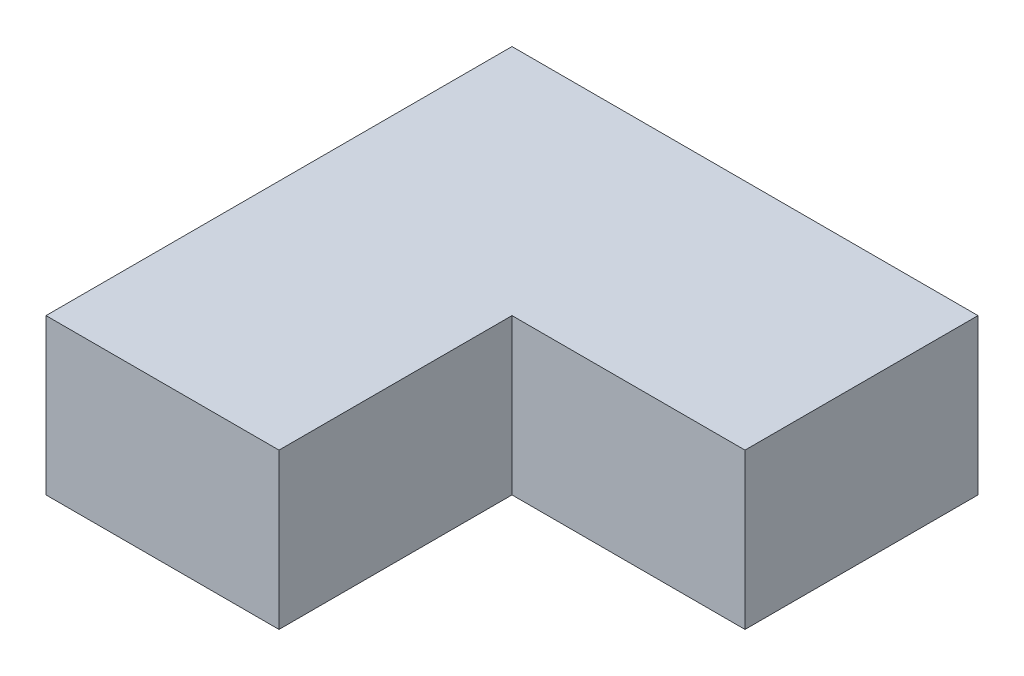
ISO-10303-21;
HEADER;
FILE_DESCRIPTION(('STEP AP214'),'2;1');
FILE_NAME('part.step','',(''),(''),'','','');
FILE_SCHEMA(('AUTOMOTIVE_DESIGN { 1 0 10303 214 1 1 1 1 }'));
ENDSEC;
DATA;
#1=APPLICATION_CONTEXT('core data for automotive mechanical design processes');
#2=APPLICATION_PROTOCOL_DEFINITION('international standard','automotive_design',2000,#1);
#3=PRODUCT_CONTEXT('',#1,'mechanical');
#4=PRODUCT('Part','Part','',(#3));
#5=PRODUCT_RELATED_PRODUCT_CATEGORY('part','',(#4));
#6=PRODUCT_DEFINITION_FORMATION('','',#4);
#7=PRODUCT_DEFINITION_CONTEXT('part definition',#1,'design');
#8=PRODUCT_DEFINITION('design','',#6,#7);
#9=PRODUCT_DEFINITION_SHAPE('','',#8);
#10=(LENGTH_UNIT() NAMED_UNIT(*) SI_UNIT(.MILLI.,.METRE.));
#11=(NAMED_UNIT(*) PLANE_ANGLE_UNIT() SI_UNIT($,.RADIAN.));
#12=(NAMED_UNIT(*) SI_UNIT($,.STERADIAN.) SOLID_ANGLE_UNIT());
#13=UNCERTAINTY_MEASURE_WITH_UNIT(LENGTH_MEASURE(1.E-05),#10,'distance_accuracy_value','');
#14=(GEOMETRIC_REPRESENTATION_CONTEXT(3) GLOBAL_UNCERTAINTY_ASSIGNED_CONTEXT((#13)) GLOBAL_UNIT_ASSIGNED_CONTEXT((#10,
#11,#12)) REPRESENTATION_CONTEXT('',''));
#15=CARTESIAN_POINT('',(0.,0.,0.));
#16=DIRECTION('',(0.,0.,1.));
#17=DIRECTION('',(1.,0.,0.));
#18=AXIS2_PLACEMENT_3D('',#15,#16,#17);
#19=CARTESIAN_POINT('',(0.,0.2,0.));
#20=DIRECTION('',(0.,1.,0.));
#21=DIRECTION('',(1.,0.,0.));
#22=AXIS2_PLACEMENT_3D('',#19,#20,#21);
#23=PLANE('',#22);
#24=DIRECTION('',(0.,0.,1.));
#25=VECTOR('',#24,1.);
#26=CARTESIAN_POINT('',(1.2,0.2,1.2));
#27=LINE('',#26,#25);
#28=CARTESIAN_POINT('',(1.2,0.2,1.2));
#29=VERTEX_POINT('',#28);
#30=CARTESIAN_POINT('',(1.2,0.2,1.5));
#31=VERTEX_POINT('',#30);
#32=EDGE_CURVE('E11',#29,#31,#27,.T.);
#33=ORIENTED_EDGE('',*,*,#32,.T.);
#34=DIRECTION('',(1.,0.,0.));
#35=VECTOR('',#34,1.);
#36=CARTESIAN_POINT('',(1.2,0.2,1.5));
#37=LINE('',#36,#35);
#38=CARTESIAN_POINT('',(1.35,0.2,1.5));
#39=VERTEX_POINT('',#38);
#40=EDGE_CURVE('E24',#31,#39,#37,.T.);
#41=ORIENTED_EDGE('',*,*,#40,.T.);
#42=DIRECTION('',(0.,0.,-1.));
#43=VECTOR('',#42,1.);
#44=CARTESIAN_POINT('',(1.35,0.2,1.5));
#45=LINE('',#44,#43);
#46=CARTESIAN_POINT('',(1.35,0.2,1.35));
#47=VERTEX_POINT('',#46);
#48=EDGE_CURVE('E116',#39,#47,#45,.T.);
#49=ORIENTED_EDGE('',*,*,#48,.T.);
#50=DIRECTION('',(1.,0.,0.));
#51=VECTOR('',#50,1.);
#52=CARTESIAN_POINT('',(1.35,0.2,1.35));
#53=LINE('',#52,#51);
#54=CARTESIAN_POINT('',(1.5,0.2,1.35));
#55=VERTEX_POINT('',#54);
#56=EDGE_CURVE('E114',#47,#55,#53,.T.);
#57=ORIENTED_EDGE('',*,*,#56,.T.);
#58=DIRECTION('',(0.,0.,-1.));
#59=VECTOR('',#58,1.);
#60=CARTESIAN_POINT('',(1.5,0.2,1.35));
#61=LINE('',#60,#59);
#62=CARTESIAN_POINT('',(1.5,0.2,1.2));
#63=VERTEX_POINT('',#62);
#64=EDGE_CURVE('E74',#55,#63,#61,.T.);
#65=ORIENTED_EDGE('',*,*,#64,.T.);
#66=DIRECTION('',(-1.,0.,0.));
#67=VECTOR('',#66,1.);
#68=CARTESIAN_POINT('',(1.5,0.2,1.2));
#69=LINE('',#68,#67);
#70=EDGE_CURVE('E36',#63,#29,#69,.T.);
#71=ORIENTED_EDGE('',*,*,#70,.T.);
#72=EDGE_LOOP('',(#33,#41,#49,#57,#65,#71));
#73=FACE_BOUND('',#72,.T.);
#74=ADVANCED_FACE('F17',(#73),#23,.T.);
#75=CARTESIAN_POINT('',(1.5,0.2,1.2));
#76=DIRECTION('',(0.,0.,-1.));
#77=DIRECTION('',(-1.,0.,0.));
#78=AXIS2_PLACEMENT_3D('',#75,#76,#77);
#79=PLANE('',#78);
#80=DIRECTION('',(0.,-1.,0.));
#81=VECTOR('',#80,1.);
#82=CARTESIAN_POINT('',(1.5,0.2,1.2));
#83=LINE('',#82,#81);
#84=CARTESIAN_POINT('',(1.5,0.1,1.2));
#85=VERTEX_POINT('',#84);
#86=EDGE_CURVE('E110',#63,#85,#83,.T.);
#87=ORIENTED_EDGE('',*,*,#86,.T.);
#88=DIRECTION('',(-1.,0.,0.));
#89=VECTOR('',#88,1.);
#90=CARTESIAN_POINT('',(1.5,0.1,1.2));
#91=LINE('',#90,#89);
#92=CARTESIAN_POINT('',(1.2,0.1,1.2));
#93=VERTEX_POINT('',#92);
#94=EDGE_CURVE('E90',#85,#93,#91,.T.);
#95=ORIENTED_EDGE('',*,*,#94,.T.);
#96=DIRECTION('',(0.,-1.,0.));
#97=VECTOR('',#96,1.);
#98=CARTESIAN_POINT('',(1.2,0.2,1.2));
#99=LINE('',#98,#97);
#100=EDGE_CURVE('E107',#29,#93,#99,.T.);
#101=ORIENTED_EDGE('',*,*,#100,.F.);
#102=ORIENTED_EDGE('',*,*,#70,.F.);
#103=EDGE_LOOP('',(#87,#95,#101,#102));
#104=FACE_BOUND('',#103,.T.);
#105=ADVANCED_FACE('F127',(#104),#79,.T.);
#106=CARTESIAN_POINT('',(1.2,0.2,1.2));
#107=DIRECTION('',(-1.,0.,0.));
#108=DIRECTION('',(0.,0.,1.));
#109=AXIS2_PLACEMENT_3D('',#106,#107,#108);
#110=PLANE('',#109);
#111=ORIENTED_EDGE('',*,*,#100,.T.);
#112=DIRECTION('',(0.,0.,1.));
#113=VECTOR('',#112,1.);
#114=CARTESIAN_POINT('',(1.2,0.1,1.2));
#115=LINE('',#114,#113);
#116=CARTESIAN_POINT('',(1.2,0.1,1.5));
#117=VERTEX_POINT('',#116);
#118=EDGE_CURVE('E104',#93,#117,#115,.T.);
#119=ORIENTED_EDGE('',*,*,#118,.T.);
#120=DIRECTION('',(0.,-1.,0.));
#121=VECTOR('',#120,1.);
#122=CARTESIAN_POINT('',(1.2,0.2,1.5));
#123=LINE('',#122,#121);
#124=EDGE_CURVE('E102',#31,#117,#123,.T.);
#125=ORIENTED_EDGE('',*,*,#124,.F.);
#126=ORIENTED_EDGE('',*,*,#32,.F.);
#127=EDGE_LOOP('',(#111,#119,#125,#126));
#128=FACE_BOUND('',#127,.T.);
#129=ADVANCED_FACE('F124',(#128),#110,.T.);
#130=CARTESIAN_POINT('',(1.2,0.2,1.5));
#131=DIRECTION('',(0.,0.,1.));
#132=DIRECTION('',(1.,0.,0.));
#133=AXIS2_PLACEMENT_3D('',#130,#131,#132);
#134=PLANE('',#133);
#135=ORIENTED_EDGE('',*,*,#124,.T.);
#136=DIRECTION('',(1.,0.,0.));
#137=VECTOR('',#136,1.);
#138=CARTESIAN_POINT('',(1.2,0.1,1.5));
#139=LINE('',#138,#137);
#140=CARTESIAN_POINT('',(1.35,0.1,1.5));
#141=VERTEX_POINT('',#140);
#142=EDGE_CURVE('E99',#117,#141,#139,.T.);
#143=ORIENTED_EDGE('',*,*,#142,.T.);
#144=DIRECTION('',(0.,-1.,0.));
#145=VECTOR('',#144,1.);
#146=CARTESIAN_POINT('',(1.35,0.2,1.5));
#147=LINE('',#146,#145);
#148=EDGE_CURVE('E97',#39,#141,#147,.T.);
#149=ORIENTED_EDGE('',*,*,#148,.F.);
#150=ORIENTED_EDGE('',*,*,#40,.F.);
#151=EDGE_LOOP('',(#135,#143,#149,#150));
#152=FACE_BOUND('',#151,.T.);
#153=ADVANCED_FACE('F119',(#152),#134,.T.);
#154=CARTESIAN_POINT('',(1.35,0.2,1.5));
#155=DIRECTION('',(1.,0.,0.));
#156=DIRECTION('',(0.,0.,-1.));
#157=AXIS2_PLACEMENT_3D('',#154,#155,#156);
#158=PLANE('',#157);
#159=ORIENTED_EDGE('',*,*,#148,.T.);
#160=DIRECTION('',(0.,0.,-1.));
#161=VECTOR('',#160,1.);
#162=CARTESIAN_POINT('',(1.35,0.1,1.5));
#163=LINE('',#162,#161);
#164=CARTESIAN_POINT('',(1.35,0.1,1.35));
#165=VERTEX_POINT('',#164);
#166=EDGE_CURVE('E95',#141,#165,#163,.T.);
#167=ORIENTED_EDGE('',*,*,#166,.T.);
#168=DIRECTION('',(0.,-1.,0.));
#169=VECTOR('',#168,1.);
#170=CARTESIAN_POINT('',(1.35,0.2,1.35));
#171=LINE('',#170,#169);
#172=EDGE_CURVE('E82',#47,#165,#171,.T.);
#173=ORIENTED_EDGE('',*,*,#172,.F.);
#174=ORIENTED_EDGE('',*,*,#48,.F.);
#175=EDGE_LOOP('',(#159,#167,#173,#174));
#176=FACE_BOUND('',#175,.T.);
#177=ADVANCED_FACE('F122',(#176),#158,.T.);
#178=CARTESIAN_POINT('',(1.35,0.2,1.35));
#179=DIRECTION('',(0.,0.,1.));
#180=DIRECTION('',(1.,0.,0.));
#181=AXIS2_PLACEMENT_3D('',#178,#179,#180);
#182=PLANE('',#181);
#183=ORIENTED_EDGE('',*,*,#172,.T.);
#184=DIRECTION('',(1.,0.,0.));
#185=VECTOR('',#184,1.);
#186=CARTESIAN_POINT('',(1.35,0.1,1.35));
#187=LINE('',#186,#185);
#188=CARTESIAN_POINT('',(1.5,0.1,1.35));
#189=VERTEX_POINT('',#188);
#190=EDGE_CURVE('E77',#165,#189,#187,.T.);
#191=ORIENTED_EDGE('',*,*,#190,.T.);
#192=DIRECTION('',(0.,-1.,0.));
#193=VECTOR('',#192,1.);
#194=CARTESIAN_POINT('',(1.5,0.2,1.35));
#195=LINE('',#194,#193);
#196=EDGE_CURVE('E68',#55,#189,#195,.T.);
#197=ORIENTED_EDGE('',*,*,#196,.F.);
#198=ORIENTED_EDGE('',*,*,#56,.F.);
#199=EDGE_LOOP('',(#183,#191,#197,#198));
#200=FACE_BOUND('',#199,.T.);
#201=ADVANCED_FACE('F80',(#200),#182,.T.);
#202=CARTESIAN_POINT('',(1.5,0.2,1.35));
#203=DIRECTION('',(1.,0.,0.));
#204=DIRECTION('',(0.,0.,-1.));
#205=AXIS2_PLACEMENT_3D('',#202,#203,#204);
#206=PLANE('',#205);
#207=ORIENTED_EDGE('',*,*,#196,.T.);
#208=DIRECTION('',(0.,0.,-1.));
#209=VECTOR('',#208,1.);
#210=CARTESIAN_POINT('',(1.5,0.1,1.35));
#211=LINE('',#210,#209);
#212=EDGE_CURVE('E73',#189,#85,#211,.T.);
#213=ORIENTED_EDGE('',*,*,#212,.T.);
#214=ORIENTED_EDGE('',*,*,#86,.F.);
#215=ORIENTED_EDGE('',*,*,#64,.F.);
#216=EDGE_LOOP('',(#207,#213,#214,#215));
#217=FACE_BOUND('',#216,.T.);
#218=ADVANCED_FACE('F70',(#217),#206,.T.);
#219=CARTESIAN_POINT('',(0.,0.1,0.));
#220=DIRECTION('',(0.,1.,0.));
#221=DIRECTION('',(1.,0.,0.));
#222=AXIS2_PLACEMENT_3D('',#219,#220,#221);
#223=PLANE('',#222);
#224=ORIENTED_EDGE('',*,*,#212,.F.);
#225=ORIENTED_EDGE('',*,*,#190,.F.);
#226=ORIENTED_EDGE('',*,*,#166,.F.);
#227=ORIENTED_EDGE('',*,*,#142,.F.);
#228=ORIENTED_EDGE('',*,*,#118,.F.);
#229=ORIENTED_EDGE('',*,*,#94,.F.);
#230=EDGE_LOOP('',(#224,#225,#226,#227,#228,#229));
#231=FACE_BOUND('',#230,.T.);
#232=ADVANCED_FACE('F87',(#231),#223,.F.);
#233=CLOSED_SHELL('',(#74,#105,#129,#153,#177,#201,#218,#232));
#234=MANIFOLD_SOLID_BREP('B1',#233);
#235=ADVANCED_BREP_SHAPE_REPRESENTATION('',(#18,#234),#14);
#236=SHAPE_DEFINITION_REPRESENTATION(#9,#235);
ENDSEC;
END-ISO-10303-21;
